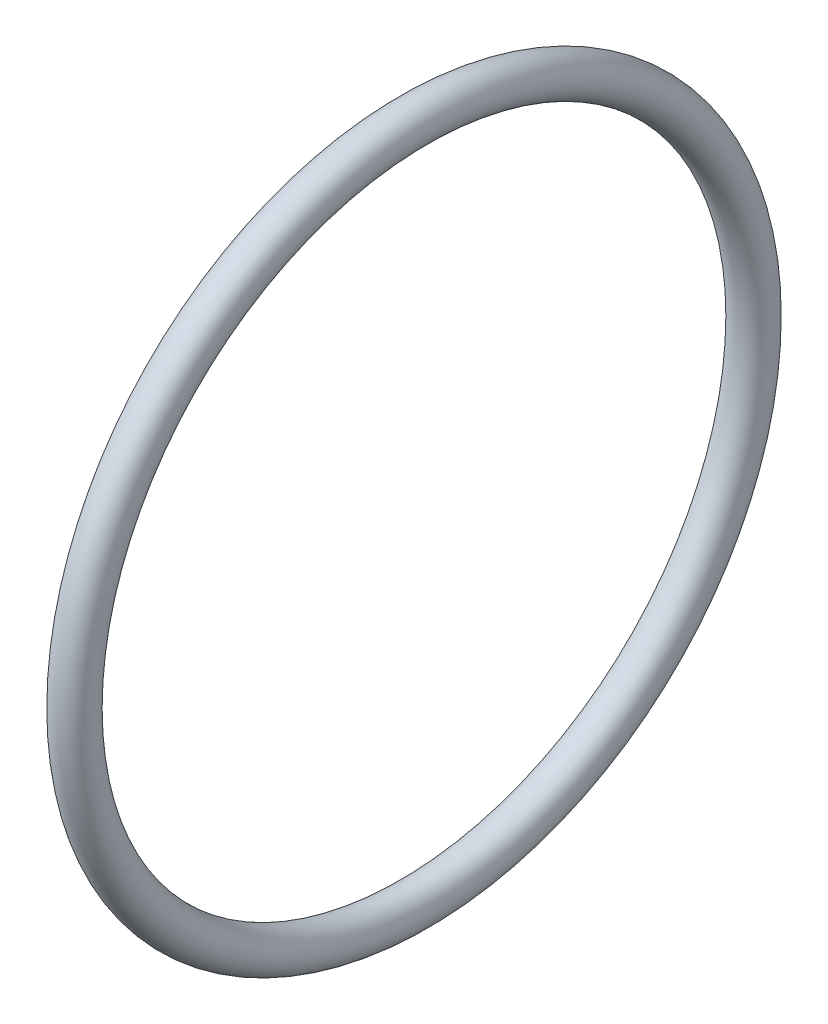
ISO-10303-21;
HEADER;
FILE_DESCRIPTION(('STEP AP214'),'2;1');
FILE_NAME('part.step','',(''),(''),'','','');
FILE_SCHEMA(('AUTOMOTIVE_DESIGN { 1 0 10303 214 1 1 1 1 }'));
ENDSEC;
DATA;
#1=APPLICATION_CONTEXT('core data for automotive mechanical design processes');
#2=APPLICATION_PROTOCOL_DEFINITION('international standard','automotive_design',2000,#1);
#3=PRODUCT_CONTEXT('',#1,'mechanical');
#4=PRODUCT('Part','Part','',(#3));
#5=PRODUCT_RELATED_PRODUCT_CATEGORY('part','',(#4));
#6=PRODUCT_DEFINITION_FORMATION('','',#4);
#7=PRODUCT_DEFINITION_CONTEXT('part definition',#1,'design');
#8=PRODUCT_DEFINITION('design','',#6,#7);
#9=PRODUCT_DEFINITION_SHAPE('','',#8);
#10=(LENGTH_UNIT() NAMED_UNIT(*) SI_UNIT(.MILLI.,.METRE.));
#11=(NAMED_UNIT(*) PLANE_ANGLE_UNIT() SI_UNIT($,.RADIAN.));
#12=(NAMED_UNIT(*) SI_UNIT($,.STERADIAN.) SOLID_ANGLE_UNIT());
#13=UNCERTAINTY_MEASURE_WITH_UNIT(LENGTH_MEASURE(1.E-05),#10,'distance_accuracy_value','');
#14=(GEOMETRIC_REPRESENTATION_CONTEXT(3) GLOBAL_UNCERTAINTY_ASSIGNED_CONTEXT((#13)) GLOBAL_UNIT_ASSIGNED_CONTEXT((#10,
#11,#12)) REPRESENTATION_CONTEXT('',''));
#15=CARTESIAN_POINT('',(0.,0.,0.));
#16=DIRECTION('',(0.,0.,1.));
#17=DIRECTION('',(1.,0.,0.));
#18=AXIS2_PLACEMENT_3D('',#15,#16,#17);
#19=CARTESIAN_POINT('',(-2.11417356615584,0.,0.));
#20=DIRECTION('',(-1.,0.,0.));
#21=DIRECTION('',(0.,0.,1.));
#22=AXIS2_PLACEMENT_3D('',#19,#20,#21);
#23=TOROIDAL_SURFACE('',#22,13.,0.75);
#24=CARTESIAN_POINT('',(-2.11417356615584,0.,13.75));
#25=VERTEX_POINT('',#24);
#26=VERTEX_LOOP('',#25);
#27=FACE_BOUND('',#26,.T.);
#28=ADVANCED_FACE('F28',(#27),#23,.T.);
#29=CLOSED_SHELL('',(#28));
#30=MANIFOLD_SOLID_BREP('B2',#29);
#31=ADVANCED_BREP_SHAPE_REPRESENTATION('',(#18,#30),#14);
#32=SHAPE_DEFINITION_REPRESENTATION(#9,#31);
ENDSEC;
END-ISO-10303-21;
